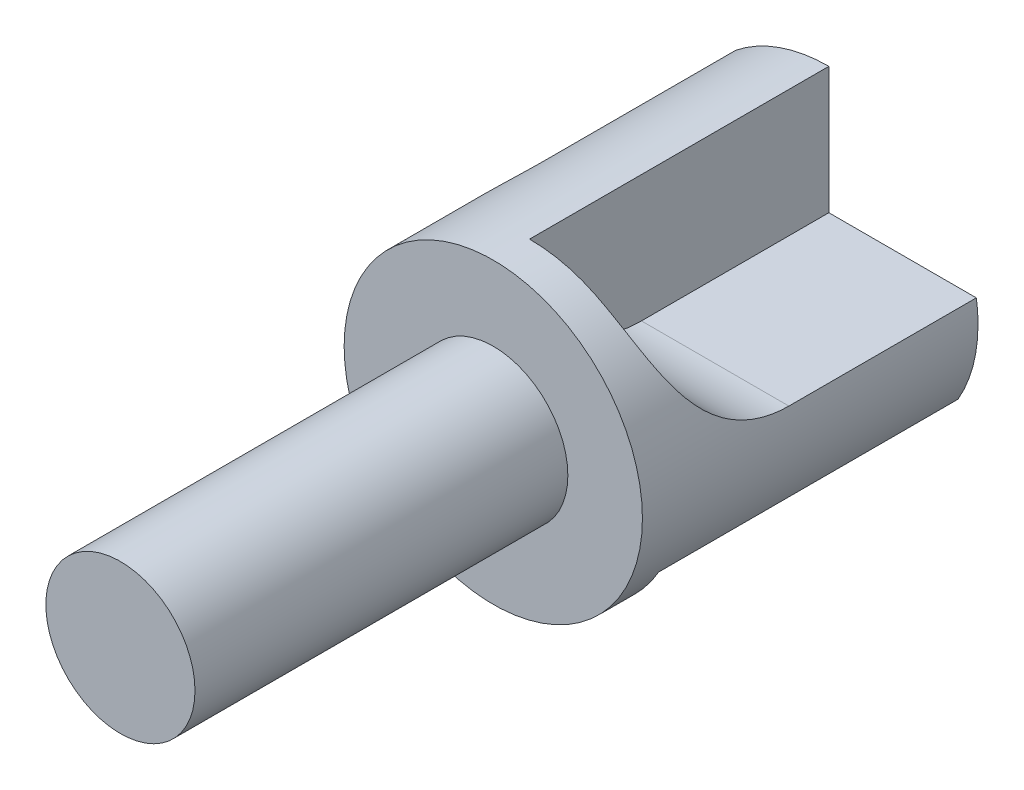
ISO-10303-21;
HEADER;
FILE_DESCRIPTION(('STEP AP214'),'2;1');
FILE_NAME('part.step','',(''),(''),'','','');
FILE_SCHEMA(('AUTOMOTIVE_DESIGN { 1 0 10303 214 1 1 1 1 }'));
ENDSEC;
DATA;
#1=APPLICATION_CONTEXT('core data for automotive mechanical design processes');
#2=APPLICATION_PROTOCOL_DEFINITION('international standard','automotive_design',2000,#1);
#3=PRODUCT_CONTEXT('',#1,'mechanical');
#4=PRODUCT('Part','Part','',(#3));
#5=PRODUCT_RELATED_PRODUCT_CATEGORY('part','',(#4));
#6=PRODUCT_DEFINITION_FORMATION('','',#4);
#7=PRODUCT_DEFINITION_CONTEXT('part definition',#1,'design');
#8=PRODUCT_DEFINITION('design','',#6,#7);
#9=PRODUCT_DEFINITION_SHAPE('','',#8);
#10=(LENGTH_UNIT() NAMED_UNIT(*) SI_UNIT(.MILLI.,.METRE.));
#11=(NAMED_UNIT(*) PLANE_ANGLE_UNIT() SI_UNIT($,.RADIAN.));
#12=(NAMED_UNIT(*) SI_UNIT($,.STERADIAN.) SOLID_ANGLE_UNIT());
#13=UNCERTAINTY_MEASURE_WITH_UNIT(LENGTH_MEASURE(1.E-05),#10,'distance_accuracy_value','');
#14=(GEOMETRIC_REPRESENTATION_CONTEXT(3) GLOBAL_UNCERTAINTY_ASSIGNED_CONTEXT((#13)) GLOBAL_UNIT_ASSIGNED_CONTEXT((#10,
#11,#12)) REPRESENTATION_CONTEXT('',''));
#15=CARTESIAN_POINT('',(0.,0.,0.));
#16=DIRECTION('',(0.,0.,1.));
#17=DIRECTION('',(1.,0.,0.));
#18=AXIS2_PLACEMENT_3D('',#15,#16,#17);
#19=CARTESIAN_POINT('',(0.,0.,-95.));
#20=DIRECTION('',(0.,0.,1.));
#21=DIRECTION('',(1.,0.,0.));
#22=AXIS2_PLACEMENT_3D('',#19,#20,#21);
#23=PLANE('',#22);
#24=DIRECTION('',(0.499999999999992,-0.866025403784443,0.));
#25=VECTOR('',#24,1.);
#26=CARTESIAN_POINT('',(-2.59807621135333,-1.49999999999998,-95.));
#27=LINE('',#26,#25);
#28=CARTESIAN_POINT('',(-12.4849361779958,15.6245437895438,-95.));
#29=VERTEX_POINT('',#28);
#30=CARTESIAN_POINT('',(-2.59807621135333,-1.49999999999998,-95.));
#31=VERTEX_POINT('',#30);
#32=EDGE_CURVE('E164',#29,#31,#27,.T.);
#33=ORIENTED_EDGE('',*,*,#32,.F.);
#34=CARTESIAN_POINT('',(0.,0.,-95.));
#35=DIRECTION('',(0.,0.,1.));
#36=DIRECTION('',(1.,0.,0.));
#37=AXIS2_PLACEMENT_3D('',#34,#35,#36);
#38=CIRCLE('',#37,20.);
#39=CARTESIAN_POINT('',(0.,20.,-95.));
#40=VERTEX_POINT('',#39);
#41=EDGE_CURVE('E194',#40,#29,#38,.T.);
#42=ORIENTED_EDGE('',*,*,#41,.F.);
#43=DIRECTION('',(0.,-1.,0.));
#44=VECTOR('',#43,1.);
#45=CARTESIAN_POINT('',(0.,0.,-95.));
#46=LINE('',#45,#44);
#47=CARTESIAN_POINT('',(0.,3.,-95.));
#48=VERTEX_POINT('',#47);
#49=EDGE_CURVE('E179',#40,#48,#46,.T.);
#50=ORIENTED_EDGE('',*,*,#49,.T.);
#51=DIRECTION('',(-1.,0.,0.));
#52=VECTOR('',#51,1.);
#53=CARTESIAN_POINT('',(0.,3.,-95.));
#54=LINE('',#53,#52);
#55=CARTESIAN_POINT('',(19.7737199332852,2.99999999999999,-95.));
#56=VERTEX_POINT('',#55);
#57=EDGE_CURVE('E182',#56,#48,#54,.T.);
#58=ORIENTED_EDGE('',*,*,#57,.F.);
#59=CARTESIAN_POINT('',(17.3205080756887,-10.0000000000001,-95.));
#60=VERTEX_POINT('',#59);
#61=EDGE_CURVE('E193',#60,#56,#38,.T.);
#62=ORIENTED_EDGE('',*,*,#61,.F.);
#63=DIRECTION('',(-0.866025403784436,0.500000000000004,0.));
#64=VECTOR('',#63,1.);
#65=CARTESIAN_POINT('',(0.,0.,-95.));
#66=LINE('',#65,#64);
#67=CARTESIAN_POINT('',(2.59807621135331,-1.50000000000001,-95.));
#68=VERTEX_POINT('',#67);
#69=EDGE_CURVE('E49',#60,#68,#66,.T.);
#70=ORIENTED_EDGE('',*,*,#69,.T.);
#71=DIRECTION('',(0.500000000000004,0.866025403784436,0.));
#72=VECTOR('',#71,1.);
#73=CARTESIAN_POINT('',(2.59807621135331,-1.50000000000001,-95.));
#74=LINE('',#73,#72);
#75=CARTESIAN_POINT('',(-7.28878375528937,-18.6245437895437,-95.));
#76=VERTEX_POINT('',#75);
#77=EDGE_CURVE('E161',#76,#68,#74,.T.);
#78=ORIENTED_EDGE('',*,*,#77,.F.);
#79=CARTESIAN_POINT('',(-17.3205080756889,-9.99999999999984,-95.));
#80=VERTEX_POINT('',#79);
#81=EDGE_CURVE('E198',#80,#76,#38,.T.);
#82=ORIENTED_EDGE('',*,*,#81,.F.);
#83=DIRECTION('',(0.866025403784443,0.499999999999992,0.));
#84=VECTOR('',#83,1.);
#85=CARTESIAN_POINT('',(0.,0.,-95.));
#86=LINE('',#85,#84);
#87=EDGE_CURVE('E57',#80,#31,#86,.T.);
#88=ORIENTED_EDGE('',*,*,#87,.T.);
#89=EDGE_LOOP('',(#33,#42,#50,#58,#62,#70,#78,#82,#88));
#90=FACE_BOUND('',#89,.T.);
#91=ADVANCED_FACE('F35',(#90),#23,.F.);
#92=CARTESIAN_POINT('',(0.,0.,0.));
#93=DIRECTION('',(0.,0.,1.));
#94=DIRECTION('',(1.,0.,0.));
#95=AXIS2_PLACEMENT_3D('',#92,#93,#94);
#96=CYLINDRICAL_SURFACE('',#95,20.);
#97=CARTESIAN_POINT('',(0.,0.,-50.));
#98=DIRECTION('',(0.,0.,1.));
#99=DIRECTION('',(1.,0.,0.));
#100=AXIS2_PLACEMENT_3D('',#97,#98,#99);
#101=CIRCLE('',#100,20.);
#102=CARTESIAN_POINT('',(20.,0.,-50.));
#103=VERTEX_POINT('',#102);
#104=EDGE_CURVE('E190',#103,#103,#101,.T.);
#105=ORIENTED_EDGE('',*,*,#104,.F.);
#106=EDGE_LOOP('',(#105));
#107=FACE_BOUND('',#106,.T.);
#108=DIRECTION('',(0.,0.,1.));
#109=VECTOR('',#108,1.);
#110=CARTESIAN_POINT('',(-12.4849361779958,15.6245437895438,0.));
#111=LINE('',#110,#109);
#112=CARTESIAN_POINT('',(-12.4849361779958,15.6245437895438,-69.8660687473185));
#113=VERTEX_POINT('',#112);
#114=EDGE_CURVE('E11',#113,#29,#111,.F.);
#115=ORIENTED_EDGE('',*,*,#114,.F.);
#116=CARTESIAN_POINT('',(-12.4849361779958,15.6245437895438,-69.8660687473185));
#117=CARTESIAN_POINT('',(-12.4849388560093,15.6245445950781,-70.2765568173716));
#118=CARTESIAN_POINT('',(-12.4982723505622,15.6139161041897,-70.6870960048679));
#119=CARTESIAN_POINT('',(-12.551394228603,15.571243896383,-71.5054971825263));
#120=CARTESIAN_POINT('',(-12.5911943070481,15.5391907123675,-71.9133579086452));
#121=CARTESIAN_POINT('',(-12.6966670533251,15.4531320118508,-72.7241959963691));
#122=CARTESIAN_POINT('',(-12.762389265022,15.3990844521208,-73.1271624745617));
#123=CARTESIAN_POINT('',(-12.9185322471459,15.2683293659461,-73.924499908596));
#124=CARTESIAN_POINT('',(-13.0089502387162,15.1916243889153,-74.3188718261402));
#125=CARTESIAN_POINT('',(-13.2129295895268,15.0145507788599,-75.0965105529148));
#126=CARTESIAN_POINT('',(-13.3265090450506,14.9141636330414,-75.4797684095354));
#127=CARTESIAN_POINT('',(-13.5746416499259,14.6886756106995,-76.2319891154629));
#128=CARTESIAN_POINT('',(-13.7091954921582,14.5635739177043,-76.6009514920212));
#129=CARTESIAN_POINT('',(-13.9965390733911,14.2876352816218,-77.3214433750374));
#130=CARTESIAN_POINT('',(-14.1493161585509,14.1368161652782,-77.6729847409535));
#131=CARTESIAN_POINT('',(-14.4700293974062,13.8083633826248,-78.3560655305448));
#132=CARTESIAN_POINT('',(-14.6379648025159,13.6307310401814,-78.6876059406093));
#133=CARTESIAN_POINT('',(-14.9799156552853,13.2538597938171,-79.3179843049604));
#134=CARTESIAN_POINT('',(-15.1535779918485,13.0554678080782,-79.6175197967092));
#135=CARTESIAN_POINT('',(-15.5079498058777,12.632480983604,-80.1930133740245));
#136=CARTESIAN_POINT('',(-15.6886591163469,12.4078867655498,-80.4689720178135));
#137=CARTESIAN_POINT('',(-16.0529413068879,11.932836367512,-80.9952298237671));
#138=CARTESIAN_POINT('',(-16.2365124690001,11.6823952315554,-81.2455437450766));
#139=CARTESIAN_POINT('',(-16.6023491595843,11.1563693359661,-81.7192439693527));
#140=CARTESIAN_POINT('',(-16.7846147674949,10.880786120406,-81.942631923994));
#141=CARTESIAN_POINT('',(-17.1308610592669,10.3263134581836,-82.3468417562552));
#142=CARTESIAN_POINT('',(-17.2952228109967,10.0490387767375,-82.5295573638467));
#143=CARTESIAN_POINT('',(-17.6158704086444,9.47570373669992,-82.8709727905216));
#144=CARTESIAN_POINT('',(-17.772156692678,9.17964439917201,-83.0296739133581));
#145=CARTESIAN_POINT('',(-18.0737006726171,8.57069390037275,-83.3235605005899));
#146=CARTESIAN_POINT('',(-18.2189571736261,8.25780092170752,-83.4587434192153));
#147=CARTESIAN_POINT('',(-18.495851225596,7.61742645336982,-83.706588699384));
#148=CARTESIAN_POINT('',(-18.6274882977309,7.28994445136151,-83.8192502692614));
#149=CARTESIAN_POINT('',(-18.8767396185688,6.61807169392278,-84.0249324824785));
#150=CARTESIAN_POINT('',(-18.9941329648651,6.2735089365399,-84.1176576393008));
#151=CARTESIAN_POINT('',(-19.2110012044641,5.5741795765726,-84.2833376966678));
#152=CARTESIAN_POINT('',(-19.3104760535986,5.21941294883869,-84.3562925484801));
#153=CARTESIAN_POINT('',(-19.4902629710051,4.50183445902153,-84.4845818042693));
#154=CARTESIAN_POINT('',(-19.5705689623354,4.13902008536337,-84.5399106222683));
#155=CARTESIAN_POINT('',(-19.7110984210887,3.4075425482669,-84.6351775942408));
#156=CARTESIAN_POINT('',(-19.7713205879565,3.03887900767665,-84.6751147515325));
#157=CARTESIAN_POINT('',(-19.8789832941454,2.2390823077362,-84.7471619369963));
#158=CARTESIAN_POINT('',(-19.9229062331266,1.80727330016892,-84.777041683214));
#159=CARTESIAN_POINT('',(-19.9825703664539,0.940987490073355,-84.8227358570986));
#160=CARTESIAN_POINT('',(-19.998309223688,0.506510469302381,-84.838549118274));
#161=CARTESIAN_POINT('',(-20.001433598143,-0.363073144815604,-84.8594431629183));
#162=CARTESIAN_POINT('',(-19.9888003433531,-0.798179964523515,-84.8645168363751));
#163=CARTESIAN_POINT('',(-19.9351844756252,-1.66666002619853,-84.8670037217522));
#164=CARTESIAN_POINT('',(-19.8942000808946,-2.10003315748615,-84.8644164521694));
#165=CARTESIAN_POINT('',(-19.7729649457267,-3.05008085683375,-84.8533893451729));
#166=CARTESIAN_POINT('',(-19.6864688571386,-3.56595582126459,-84.8438758481531));
#167=CARTESIAN_POINT('',(-19.4733510362661,-4.58931890920119,-84.8221183118294));
#168=CARTESIAN_POINT('',(-19.3467249483796,-5.09680611602849,-84.8098739761703));
#169=CARTESIAN_POINT('',(-19.0540978421257,-6.10037250224661,-84.7861349538014));
#170=CARTESIAN_POINT('',(-18.8880935752787,-6.59645073675546,-84.7746403290383));
#171=CARTESIAN_POINT('',(-18.5177148378756,-7.57413488835499,-84.755011739617));
#172=CARTESIAN_POINT('',(-18.3133402012639,-8.05574074280304,-84.7468777895031));
#173=CARTESIAN_POINT('',(-17.8508742651342,-9.03668725120949,-84.7352033786866));
#174=CARTESIAN_POINT('',(-17.5899196637306,-9.53468597333757,-84.732049217554));
#175=CARTESIAN_POINT('',(-17.0270111373269,-10.5069731874892,-84.7322296663077));
#176=CARTESIAN_POINT('',(-16.7250546798151,-10.9812602124634,-84.7355646771726));
#177=CARTESIAN_POINT('',(-16.0821657809494,-11.9029327103123,-84.7479898678782));
#178=CARTESIAN_POINT('',(-15.7412126151872,-12.3503036844001,-84.757083119632));
#179=CARTESIAN_POINT('',(-15.0229097835634,-13.214687476062,-84.7789018843821));
#180=CARTESIAN_POINT('',(-14.6455607377233,-13.6317008105811,-84.7916273355093));
#181=CARTESIAN_POINT('',(-13.8586873256462,-14.4308694093808,-84.8172503860117));
#182=CARTESIAN_POINT('',(-13.449298198369,-14.8131578814905,-84.8301470892918));
#183=CARTESIAN_POINT('',(-12.5997985225637,-15.5421474212402,-84.8516717735068));
#184=CARTESIAN_POINT('',(-12.1596857931065,-15.8888459581879,-84.8602994510505));
#185=CARTESIAN_POINT('',(-11.2521133494602,-16.5439716960761,-84.8678095765551));
#186=CARTESIAN_POINT('',(-10.7846691313465,-16.8524202797633,-84.8666974944361));
#187=CARTESIAN_POINT('',(-9.82580941066607,-17.4288891228456,-84.8484285518367));
#188=CARTESIAN_POINT('',(-9.33439952398189,-17.6969187939486,-84.8312754332969));
#189=CARTESIAN_POINT('',(-8.43507262367495,-18.1396408262291,-84.779824658412));
#190=CARTESIAN_POINT('',(-8.03076775106434,-18.3221925462472,-84.7497781700545));
#191=CARTESIAN_POINT('',(-7.21243106370216,-18.6594906214705,-84.6714103154312));
#192=CARTESIAN_POINT('',(-6.79840045507123,-18.8142404041157,-84.6230912041092));
#193=CARTESIAN_POINT('',(-5.96413441701259,-19.0950949077421,-84.5044219639013));
#194=CARTESIAN_POINT('',(-5.54390395604561,-19.2212213663345,-84.4340886506516));
#195=CARTESIAN_POINT('',(-4.70080301016365,-19.4446030678567,-84.2676770416043));
#196=CARTESIAN_POINT('',(-4.27793249898262,-19.5418580230726,-84.1715984892653));
#197=CARTESIAN_POINT('',(-3.43008886180597,-19.7084467239093,-83.9492622303785));
#198=CARTESIAN_POINT('',(-3.00513416731181,-19.7775052282754,-83.8227253384138));
#199=CARTESIAN_POINT('',(-2.16249525948923,-19.8872852805619,-83.537115126894));
#200=CARTESIAN_POINT('',(-1.74481106190667,-19.9280067671198,-83.3780417368836));
#201=CARTESIAN_POINT('',(-0.922718189569013,-19.9829477160218,-83.025559024581));
#202=CARTESIAN_POINT('',(-0.518299807981444,-19.997187000912,-82.8321755030943));
#203=CARTESIAN_POINT('',(0.271855311659246,-20.0020538064562,-82.4101978573861));
#204=CARTESIAN_POINT('',(0.657595038312627,-19.9926851172133,-82.1816093906161));
#205=CARTESIAN_POINT('',(1.3484034222376,-19.9570225231409,-81.7269907124691));
#206=CARTESIAN_POINT('',(1.65683589638892,-19.9335101410291,-81.5058273780411));
#207=CARTESIAN_POINT('',(2.25366818251381,-19.8748804048866,-81.0393780127454));
#208=CARTESIAN_POINT('',(2.54207027840324,-19.8397643765714,-80.7940947398261));
#209=CARTESIAN_POINT('',(3.09657840947892,-19.760811894362,-80.2807295323183));
#210=CARTESIAN_POINT('',(3.36268103665468,-19.7169741109705,-80.0126441254665));
#211=CARTESIAN_POINT('',(3.87075987511725,-19.623556294618,-79.4554408254582));
#212=CARTESIAN_POINT('',(4.1127354257666,-19.5739761045013,-79.1663223567578));
#213=CARTESIAN_POINT('',(4.56533167041582,-19.4733181285762,-78.5767732066347));
#214=CARTESIAN_POINT('',(4.77660017176099,-19.4223119662396,-78.2768267188189));
#215=CARTESIAN_POINT('',(5.17418576360317,-19.3201951708944,-77.6608747900893));
#216=CARTESIAN_POINT('',(5.36050363455768,-19.2690845412043,-77.3448698519116));
#217=CARTESIAN_POINT('',(5.70771469418713,-19.1691066627496,-76.6988082348763));
#218=CARTESIAN_POINT('',(5.86860460415169,-19.1202397038618,-76.368749750892));
#219=CARTESIAN_POINT('',(6.16466185009109,-19.0268505972777,-75.6966944361243));
#220=CARTESIAN_POINT('',(6.29982787903843,-18.9823286704079,-75.3546969997683));
#221=CARTESIAN_POINT('',(6.55286834099547,-18.8965346362549,-74.6365628452302));
#222=CARTESIAN_POINT('',(6.66887031298193,-18.8557081045948,-74.2597120645201));
#223=CARTESIAN_POINT('',(6.87123973038725,-18.7829079700861,-73.4972978305574));
#224=CARTESIAN_POINT('',(6.95760602355425,-18.750934711467,-73.1117340391592));
#225=CARTESIAN_POINT('',(7.10074077954609,-18.697201225688,-72.3343643145016));
#226=CARTESIAN_POINT('',(7.15750280854053,-18.675443218689,-71.9425570434113));
#227=CARTESIAN_POINT('',(7.24143753091021,-18.6430577841822,-71.1553299268343));
#228=CARTESIAN_POINT('',(7.2686097060989,-18.6324305516,-70.7599100182042));
#229=CARTESIAN_POINT('',(7.29394126767888,-18.6225303452376,-69.9502566301358));
#230=CARTESIAN_POINT('',(7.29074698473162,-18.6237871213751,-69.5359735886962));
#231=CARTESIAN_POINT('',(7.25207802559355,-18.638878386092,-68.709136260454));
#232=CARTESIAN_POINT('',(7.21660223968459,-18.6527133070613,-68.2965820335714));
#233=CARTESIAN_POINT('',(7.11332710743882,-18.6923415851914,-67.4760354570572));
#234=CARTESIAN_POINT('',(7.04552163285925,-18.7181372095335,-67.0680439873298));
#235=CARTESIAN_POINT('',(6.87754307274594,-18.78050635534,-66.2596153394524));
#236=CARTESIAN_POINT('',(6.77737018052817,-18.817079812433,-65.8591781161993));
#237=CARTESIAN_POINT('',(6.5441154789633,-18.899468545701,-65.0669776077705));
#238=CARTESIAN_POINT('',(6.41088665263933,-18.9453249354652,-64.6752618310291));
#239=CARTESIAN_POINT('',(6.11183098542198,-19.0439043665413,-63.9053509312971));
#240=CARTESIAN_POINT('',(5.9460037492872,-19.0966274911067,-63.5271559723062));
#241=CARTESIAN_POINT('',(5.5820582970805,-19.2061633401887,-62.7873406134673));
#242=CARTESIAN_POINT('',(5.38394725075848,-19.2629751551078,-62.4257165562651));
#243=CARTESIAN_POINT('',(4.95598306179941,-19.3774938009964,-61.721905084845));
#244=CARTESIAN_POINT('',(4.72613140478076,-19.4352005899644,-61.3797167619955));
#245=CARTESIAN_POINT('',(4.24439116342046,-19.5459462198962,-60.7293461520465));
#246=CARTESIAN_POINT('',(3.99357057960101,-19.5990779881351,-60.4203889056844));
#247=CARTESIAN_POINT('',(3.46477746006156,-19.6994340006554,-59.8255956726275));
#248=CARTESIAN_POINT('',(3.18680566944888,-19.7466584069707,-59.5397590518294));
#249=CARTESIAN_POINT('',(2.60595677771956,-19.8316677744522,-58.9934975801437));
#250=CARTESIAN_POINT('',(2.30309753877767,-19.869459428369,-58.733054792169));
#251=CARTESIAN_POINT('',(1.67499639409361,-19.9322336097005,-58.2390087260842));
#252=CARTESIAN_POINT('',(1.34975595981534,-19.957216978292,-58.0054036862023));
#253=CARTESIAN_POINT('',(0.704302159816196,-19.9900160359226,-57.5818839360599));
#254=CARTESIAN_POINT('',(0.385411103790001,-19.9989377035824,-57.3900349609748));
#255=CARTESIAN_POINT('',(-0.265792480281265,-20.0008834384256,-57.0306146330377));
#256=CARTESIAN_POINT('',(-0.598104259568107,-19.9939083913055,-56.8630419281697));
#257=CARTESIAN_POINT('',(-1.27296079065285,-19.9623065893218,-56.5518631588347));
#258=CARTESIAN_POINT('',(-1.61550631107147,-19.9376785053898,-56.4082588999167));
#259=CARTESIAN_POINT('',(-2.30753954939837,-19.8694780268077,-56.1441746921828));
#260=CARTESIAN_POINT('',(-2.65702746956496,-19.8259050794475,-56.0236954181786));
#261=CARTESIAN_POINT('',(-3.36060968933859,-19.7188549249632,-55.8042580755178));
#262=CARTESIAN_POINT('',(-3.71471309560165,-19.6553297644424,-55.7053528389524));
#263=CARTESIAN_POINT('',(-4.42371657789966,-19.5079944362614,-55.5276900180815));
#264=CARTESIAN_POINT('',(-4.7786166499745,-19.4241843692142,-55.4489323338482));
#265=CARTESIAN_POINT('',(-5.48665763153911,-19.2361847953943,-55.3095224451558));
#266=CARTESIAN_POINT('',(-5.83979798030417,-19.1319891716651,-55.2488756889543));
#267=CARTESIAN_POINT('',(-6.54189493537403,-18.9034374796417,-55.1435347226216));
#268=CARTESIAN_POINT('',(-6.89085127066793,-18.7790801129073,-55.0988415405135));
#269=CARTESIAN_POINT('',(-7.63369760599096,-18.4907532035489,-55.0175727155995));
#270=CARTESIAN_POINT('',(-8.02660856496578,-18.32364567865,-54.9831721863259));
#271=CARTESIAN_POINT('',(-8.80173154564653,-17.9641893233363,-54.9290654941343));
#272=CARTESIAN_POINT('',(-9.18394273139016,-17.7718385273315,-54.9093604762949));
#273=CARTESIAN_POINT('',(-9.93578685731186,-17.3627020350474,-54.8814004358212));
#274=CARTESIAN_POINT('',(-10.3054115040711,-17.1459006186086,-54.873152825454));
#275=CARTESIAN_POINT('',(-11.0300380841771,-16.6889717895042,-54.8650962490305));
#276=CARTESIAN_POINT('',(-11.3850390852145,-16.448842892896,-54.8652878201712));
#277=CARTESIAN_POINT('',(-12.1498829667086,-15.894859870661,-54.8719379690439));
#278=CARTESIAN_POINT('',(-12.5560820528134,-15.5759746385878,-54.8796710093793));
#279=CARTESIAN_POINT('',(-13.3425727069319,-14.9077863112934,-54.89902734734));
#280=CARTESIAN_POINT('',(-13.7228614321675,-14.5584798879324,-54.9106510710104));
#281=CARTESIAN_POINT('',(-14.4553504150578,-13.8314545447329,-54.9341927920998));
#282=CARTESIAN_POINT('',(-14.8075464183966,-13.4537313382699,-54.9461108337333));
#283=CARTESIAN_POINT('',(-15.481705235448,-12.6721415514659,-54.967437482336));
#284=CARTESIAN_POINT('',(-15.80366770132,-12.2682746704289,-54.9768460604359));
#285=CARTESIAN_POINT('',(-16.442261656233,-11.4003137503462,-54.9918612626978));
#286=CARTESIAN_POINT('',(-16.7559518970348,-10.9340436036127,-54.997062319487));
#287=CARTESIAN_POINT('',(-17.3430191889037,-9.97672326144551,-55.0010520066418));
#288=CARTESIAN_POINT('',(-17.6163935468907,-9.48567141354525,-54.9998402088312));
#289=CARTESIAN_POINT('',(-18.1209508556091,-8.48213911280022,-54.9912695431667));
#290=CARTESIAN_POINT('',(-18.3521157164911,-7.96964958745342,-54.9839080472183));
#291=CARTESIAN_POINT('',(-18.7704667687874,-6.92712421171099,-54.964708975176));
#292=CARTESIAN_POINT('',(-18.9576538234094,-6.3970887059454,-54.95287148695));
#293=CARTESIAN_POINT('',(-19.2860048580893,-5.32564890855583,-54.927774249963));
#294=CARTESIAN_POINT('',(-19.4273759627048,-4.78430790140285,-54.9145212726319));
#295=CARTESIAN_POINT('',(-19.6643015050414,-3.6915845446514,-54.8906693871639));
#296=CARTESIAN_POINT('',(-19.7598528690145,-3.1402015239743,-54.8800706571059));
#297=CARTESIAN_POINT('',(-19.9044182920293,-2.03141266133283,-54.8666742864604));
#298=CARTESIAN_POINT('',(-19.9534451658355,-1.47400852064048,-54.8638744973113));
#299=CARTESIAN_POINT('',(-20.0046171500885,-0.35718126328975,-54.872098572172));
#300=CARTESIAN_POINT('',(-20.0067721121859,0.202241404386612,-54.8831195307889));
#301=CARTESIAN_POINT('',(-19.9682895626287,1.21386612157393,-54.9217602185841));
#302=CARTESIAN_POINT('',(-19.9355962147559,1.66651378186438,-54.9458820322013));
#303=CARTESIAN_POINT('',(-19.8397057393197,2.5673207066223,-55.0116443954531));
#304=CARTESIAN_POINT('',(-19.7765108183836,3.01548029338445,-55.0532836777635));
#305=CARTESIAN_POINT('',(-19.6205410971763,3.90350089850979,-55.1580554765006));
#306=CARTESIAN_POINT('',(-19.5278056376545,4.34337213439145,-55.2211594148086));
#307=CARTESIAN_POINT('',(-19.3141765103579,5.21175334119677,-55.3728812000385));
#308=CARTESIAN_POINT('',(-19.1932873162398,5.64026510511511,-55.4614949939466));
#309=CARTESIAN_POINT('',(-18.9465406135544,6.41619538612462,-55.6518413088965));
#310=CARTESIAN_POINT('',(-18.8244030121915,6.76583262386264,-55.749368042609));
#311=CARTESIAN_POINT('',(-18.5636214835391,7.45160822599238,-55.9671907645579));
#312=CARTESIAN_POINT('',(-18.4249792524134,7.78774797276743,-56.08748441381));
#313=CARTESIAN_POINT('',(-18.1336645133786,8.44387443585858,-56.3523362248823));
#314=CARTESIAN_POINT('',(-17.9809970160381,8.76386685804679,-56.4968857363594));
#315=CARTESIAN_POINT('',(-17.6645274196038,9.38541929080936,-56.8112831360942));
#316=CARTESIAN_POINT('',(-17.5007251763948,9.68697906271713,-56.9811313518225));
#317=CARTESIAN_POINT('',(-17.1648856031553,10.2703611978067,-57.3470236650202));
#318=CARTESIAN_POINT('',(-16.9928263568633,10.5521255152833,-57.5431402701526));
#319=CARTESIAN_POINT('',(-16.6445991132719,11.0932806429011,-57.9609377788035));
#320=CARTESIAN_POINT('',(-16.4684310793261,11.3526712533931,-58.1826189104028));
#321=CARTESIAN_POINT('',(-16.1157870729764,11.8479478636934,-58.6507071922869));
#322=CARTESIAN_POINT('',(-15.9393110551984,12.0838300384733,-58.8971183533162));
#323=CARTESIAN_POINT('',(-15.5898649332765,12.5314307056834,-59.4132464043681));
#324=CARTESIAN_POINT('',(-15.4168947730018,12.743149585234,-59.6829629208939));
#325=CARTESIAN_POINT('',(-15.0855845820268,13.1334592652093,-60.2314410447204));
#326=CARTESIAN_POINT('',(-14.9269359821975,13.3131040102589,-60.5092683459618));
#327=CARTESIAN_POINT('',(-14.6189969046718,13.650535392607,-61.0827796781205));
#328=CARTESIAN_POINT('',(-14.4697061507882,13.8083226751727,-61.378463181524));
#329=CARTESIAN_POINT('',(-14.1829751756745,14.102676103821,-61.9859472227737));
#330=CARTESIAN_POINT('',(-14.045541927219,14.2392298009042,-62.2977570736276));
#331=CARTESIAN_POINT('',(-13.7848817852142,14.4917206879089,-62.9353392246192));
#332=CARTESIAN_POINT('',(-13.6616552292439,14.6076573879656,-63.2611118562879));
#333=CARTESIAN_POINT('',(-13.4243903282863,14.8261026202917,-63.9446325351865));
#334=CARTESIAN_POINT('',(-13.3113557719065,14.9273779669459,-64.3031236501454));
#335=CARTESIAN_POINT('',(-13.1053452336799,15.1085656337647,-65.0311405458154));
#336=CARTESIAN_POINT('',(-13.0123719931791,15.1884750346641,-65.4006678267565));
#337=CARTESIAN_POINT('',(-12.8481451552869,15.3276461610226,-66.1477263708014));
#338=CARTESIAN_POINT('',(-12.7768592466789,15.3869386219853,-66.5252448215931));
#339=CARTESIAN_POINT('',(-12.6569772490144,15.4857023583701,-67.286288919452));
#340=CARTESIAN_POINT('',(-12.6083723696727,15.5251813131856,-67.6698121796269));
#341=CARTESIAN_POINT('',(-12.5427148014869,15.5782421188539,-68.3554870626527));
#342=CARTESIAN_POINT('',(-12.5210663501803,15.5956162186612,-68.6569194887771));
#343=CARTESIAN_POINT('',(-12.4921760406154,15.6187667657786,-69.2609149323722));
#344=CARTESIAN_POINT('',(-12.4849342039013,15.6245431957452,-69.563477951533));
#345=CARTESIAN_POINT('',(-12.4849361779958,15.6245437895438,-69.8660687473185));
#346=B_SPLINE_CURVE_WITH_KNOTS('',3,(#116,#117,#118,#119,#120,#121,#122,#123,#124,#125,#126,
#127,#128,#129,#130,#131,#132,#133,#134,#135,#136,#137,#138,#139,#140,#141,#142,#143,#144,#145,
#146,#147,#148,#149,#150,#151,#152,#153,#154,#155,#156,#157,#158,#159,#160,#161,#162,#163,#164,
#165,#166,#167,#168,#169,#170,#171,#172,#173,#174,#175,#176,#177,#178,#179,#180,#181,#182,#183,
#184,#185,#186,#187,#188,#189,#190,#191,#192,#193,#194,#195,#196,#197,#198,#199,#200,#201,#202,
#203,#204,#205,#206,#207,#208,#209,#210,#211,#212,#213,#214,#215,#216,#217,#218,#219,#220,#221,
#222,#223,#224,#225,#226,#227,#228,#229,#230,#231,#232,#233,#234,#235,#236,#237,#238,#239,#240,
#241,#242,#243,#244,#245,#246,#247,#248,#249,#250,#251,#252,#253,#254,#255,#256,#257,#258,#259,
#260,#261,#262,#263,#264,#265,#266,#267,#268,#269,#270,#271,#272,#273,#274,#275,#276,#277,#278,
#279,#280,#281,#282,#283,#284,#285,#286,#287,#288,#289,#290,#291,#292,#293,#294,#295,#296,#297,
#298,#299,#300,#301,#302,#303,#304,#305,#306,#307,#308,#309,#310,#311,#312,#313,#314,#315,#316,
#317,#318,#319,#320,#321,#322,#323,#324,#325,#326,#327,#328,#329,#330,#331,#332,#333,#334,#335,
#336,#337,#338,#339,#340,#341,#342,#343,#344,#345),.UNSPECIFIED.,.T.,.F.,(4,2,2,2,2,2,2,2,2,2,2,
2,2,2,2,2,2,2,2,2,2,2,2,2,2,2,2,2,2,2,2,2,2,2,2,2,2,2,2,2,2,2,2,2,2,2,2,2,2,2,2,2,2,2,2,2,2,2,2,
2,2,2,2,2,2,2,2,2,2,2,2,2,2,2,2,2,2,2,2,2,2,2,2,2,2,2,2,2,2,2,2,2,2,2,2,2,2,2,2,2,2,2,2,2,2,2,2,
2,2,2,2,2,2,2,4),(0.,1.23119889211008,2.46294218371251,3.69705115097648,4.93102130909127,
6.16595929996852,7.40093809518757,8.63506428502451,9.86912956148705,11.0646965677405,
12.2602352590387,13.4550819779346,14.6498553659946,15.760058993158,16.8702023254205,
17.9804657524557,19.0907682003927,20.2165384778115,21.3423115301542,22.4684410042542,
23.5946433882386,24.8985986618008,26.2026620583942,27.5075885244528,28.8125970090713,
30.3804063063643,31.9483858277748,33.5164947437389,35.0846104461701,36.7692641483486,
38.4540219518553,40.1396792999871,41.8253079371908,43.5041701114209,45.1831515818788,
46.8611901846037,48.5388374438663,49.8714796342387,51.2039574227559,52.5354198665338,
53.8668955783157,55.2110745336112,56.5552563996572,57.8984317086249,59.2413913934727,
60.3807350467653,61.519948575124,62.6593358922819,63.7987543991022,64.9087806998612,
66.0187722708044,67.1289068487692,68.239097817497,69.4269940535321,70.6149364704095,
71.8031369527648,72.991358242915,74.2327876930707,75.4742598205715,76.7159673684964,
77.9576675003996,79.204992348436,80.4523323206712,81.6993956539962,82.9464006383283,
84.1492664509544,85.352099262747,86.5540761958573,87.7559741796999,88.871386921545,
89.9867375189129,91.1021720980324,92.2176392217716,93.3358080568562,94.4539713459426,
95.5724706707596,96.6910420568976,97.9748871985834,99.258832367407,100.54360778684,
101.828464988909,103.376256386251,104.924217328335,106.472412247776,108.020624977208,
109.704551189777,111.388589836843,113.073348531969,114.758074155453,116.435073644619,
118.112185617028,119.788835509397,121.465132996071,122.827271021173,124.189310517562,
125.549543642107,126.909560771546,128.057323144697,129.204967665154,130.352203768808,
131.49945472377,132.649940288995,133.800436119384,134.951118840951,136.101783124834,
137.201323200903,138.300830809868,139.400980636139,140.50115659874,141.667749845016,
142.834502403541,143.999508046998,145.164061803793,146.071637255047,146.979214063517),.UNSPECIFIED.);
#347=CARTESIAN_POINT('',(-19.9473562116606,-1.45016556472906,-54.8660687473185));
#348=VERTEX_POINT('',#347);
#349=EDGE_CURVE('E42',#348,#113,#346,.T.);
#350=ORIENTED_EDGE('',*,*,#349,.F.);
#351=CARTESIAN_POINT('',(0.,0.,-54.8660687473185));
#352=DIRECTION('',(0.,0.,-1.));
#353=DIRECTION('',(-1.,0.,0.));
#354=AXIS2_PLACEMENT_3D('',#351,#352,#353);
#355=CIRCLE('',#354,20.);
#356=CARTESIAN_POINT('',(-17.3205080756889,-9.99999999999984,-54.8660687473185));
#357=VERTEX_POINT('',#356);
#358=EDGE_CURVE('E129',#357,#348,#355,.T.);
#359=ORIENTED_EDGE('',*,*,#358,.F.);
#360=DIRECTION('',(0.,0.,1.));
#361=VECTOR('',#360,1.);
#362=CARTESIAN_POINT('',(-17.3205080756889,-9.99999999999984,0.));
#363=LINE('',#362,#361);
#364=EDGE_CURVE('E140',#357,#80,#363,.F.);
#365=ORIENTED_EDGE('',*,*,#364,.T.);
#366=ORIENTED_EDGE('',*,*,#81,.T.);
#367=DIRECTION('',(0.,0.,1.));
#368=VECTOR('',#367,1.);
#369=CARTESIAN_POINT('',(-7.28878375528937,-18.6245437895437,0.));
#370=LINE('',#369,#368);
#371=CARTESIAN_POINT('',(-7.28878375528936,-18.6245437895437,-69.8660687473185));
#372=VERTEX_POINT('',#371);
#373=EDGE_CURVE('E278',#372,#76,#370,.F.);
#374=ORIENTED_EDGE('',*,*,#373,.F.);
#375=CARTESIAN_POINT('',(11.2295583245791,-16.5498344352708,-54.8660687473185));
#376=CARTESIAN_POINT('',(11.0297846960521,-16.6853867687993,-54.8660730009485));
#377=CARTESIAN_POINT('',(10.8275736086359,-16.8173095267159,-54.8671759306577));
#378=CARTESIAN_POINT('',(10.4185170691759,-17.0737457963837,-54.8721088605679));
#379=CARTESIAN_POINT('',(10.2116712347222,-17.1982586936303,-54.8759390866047));
#380=CARTESIAN_POINT('',(9.58422082303259,-17.5606394352732,-54.8923249235602));
#381=CARTESIAN_POINT('',(9.15705976349363,-17.7871075155393,-54.9097775761928));
#382=CARTESIAN_POINT('',(8.28579858161307,-18.2093742750545,-54.9624479807828));
#383=CARTESIAN_POINT('',(7.84161392198787,-18.4049856141733,-54.997769152912));
#384=CARTESIAN_POINT('',(6.94239285707633,-18.7626500891037,-55.0911304438384));
#385=CARTESIAN_POINT('',(6.48736197847387,-18.9247199248833,-55.1491592149502));
#386=CARTESIAN_POINT('',(5.64988856344815,-19.1895029587941,-55.2804825573447));
#387=CARTESIAN_POINT('',(5.26846920841637,-19.2976327758109,-55.3494151124824));
#388=CARTESIAN_POINT('',(4.50413110879251,-19.4902040167251,-55.5089378072496));
#389=CARTESIAN_POINT('',(4.12121240662911,-19.5746461060981,-55.5995273383224));
#390=CARTESIAN_POINT('',(3.35852976392541,-19.7197995388805,-55.8045004449837));
#391=CARTESIAN_POINT('',(2.97875971672195,-19.780583837652,-55.9188091769434));
#392=CARTESIAN_POINT('',(2.22498529095844,-19.8794847187297,-56.1734056413863));
#393=CARTESIAN_POINT('',(1.85098082218656,-19.917601656055,-56.3136929669444));
#394=CARTESIAN_POINT('',(1.11043165878662,-19.9726232327684,-56.6226664506053));
#395=CARTESIAN_POINT('',(0.743949765290074,-19.9893910142953,-56.7915280484568));
#396=CARTESIAN_POINT('',(0.0251003053502935,-20.0032153273677,-57.1577551756164));
#397=CARTESIAN_POINT('',(-0.327267047397557,-20.000271560592,-57.3551211362749));
#398=CARTESIAN_POINT('',(-1.01414644192749,-19.9772297364825,-57.7784417275025));
#399=CARTESIAN_POINT('',(-1.34864567863894,-19.9571195476446,-58.0044164796833));
#400=CARTESIAN_POINT('',(-1.99595609901848,-19.9028056777448,-58.4840105488978));
#401=CARTESIAN_POINT('',(-2.30876854726827,-19.8686028192516,-58.7376282518172));
#402=CARTESIAN_POINT('',(-2.88262048105623,-19.7930942759277,-59.2469140498598));
#403=CARTESIAN_POINT('',(-3.14578467585573,-19.7527079893116,-59.5003321441681));
#404=CARTESIAN_POINT('',(-3.64998022324307,-19.6657848717674,-60.0272903966808));
#405=CARTESIAN_POINT('',(-3.89101303578652,-19.6192484470442,-60.3008292254202));
#406=CARTESIAN_POINT('',(-4.34965970700808,-19.5226895837147,-60.8663000293445));
#407=CARTESIAN_POINT('',(-4.56727275777981,-19.472667024946,-61.1582326385052));
#408=CARTESIAN_POINT('',(-4.97817241433698,-19.3716951975628,-61.7585859775625));
#409=CARTESIAN_POINT('',(-5.1714581869833,-19.3207458972784,-62.067007271634));
#410=CARTESIAN_POINT('',(-5.53939985041536,-19.2185530585329,-62.7093157645378));
#411=CARTESIAN_POINT('',(-5.71317513704803,-19.1673608006331,-63.0437154418148));
#412=CARTESIAN_POINT('',(-6.03368514584049,-19.0688952072201,-63.7257987113513));
#413=CARTESIAN_POINT('',(-6.18041810469117,-19.0216221273693,-64.0734831680684));
#414=CARTESIAN_POINT('',(-6.44665352208909,-18.9330490229902,-64.7798399780864));
#415=CARTESIAN_POINT('',(-6.56615654623722,-18.8917488744028,-65.1385121029836));
#416=CARTESIAN_POINT('',(-6.77786922454862,-18.816830735878,-65.864558869658));
#417=CARTESIAN_POINT('',(-6.87008346035181,-18.7832114565806,-66.2319320393777));
#418=CARTESIAN_POINT('',(-7.00542812442117,-18.7330616929286,-66.8702297431374));
#419=CARTESIAN_POINT('',(-7.05507818181684,-18.7143780037669,-67.1396259275699));
#420=CARTESIAN_POINT('',(-7.14016049909174,-18.6820817055767,-67.6809236715932));
#421=CARTESIAN_POINT('',(-7.17559501793338,-18.6684682908658,-67.9528248260939));
#422=CARTESIAN_POINT('',(-7.23221684972573,-18.6466085148408,-68.4978440366293));
#423=CARTESIAN_POINT('',(-7.25342853788164,-18.6383529719449,-68.7709591990335));
#424=CARTESIAN_POINT('',(-7.28171242067996,-18.6273105436587,-69.3180718817419));
#425=CARTESIAN_POINT('',(-7.28878250334528,-18.6245244751078,-69.5920695277213));
#426=CARTESIAN_POINT('',(-7.28878375528936,-18.6245437895437,-69.8660687473185));
#427=B_SPLINE_CURVE_WITH_KNOTS('',3,(#375,#376,#377,#378,#379,#380,#381,#382,#383,#384,#385,
#386,#387,#388,#389,#390,#391,#392,#393,#394,#395,#396,#397,#398,#399,#400,#401,#402,#403,#404,
#405,#406,#407,#408,#409,#410,#411,#412,#413,#414,#415,#416,#417,#418,#419,#420,#421,#422,#423,
#424,#425,#426),.UNSPECIFIED.,.F.,.F.,(4,2,2,2,2,2,2,2,2,2,2,2,2,2,2,2,2,2,2,2,2,2,2,2,2,4),(0.,
0.724174997655315,1.44840996815565,2.89816865057049,4.3564159846099,5.81393551633054,
7.01995251313865,8.22593562509765,9.42816971597366,10.6303849768131,11.8402688126618,
13.0501709593398,14.2609288519553,15.4716160843939,16.5730585178643,17.6744282394683,
18.7758359426116,19.8772813555343,21.0169955074406,22.1567839487306,23.2965487129849,
24.4361220081917,25.2594338509371,26.0826148109953,26.9043813660134,27.72627063854),.UNSPECIFIED.);
#428=CARTESIAN_POINT('',(11.2295583245791,-16.5498344352708,-54.8660687473185));
#429=VERTEX_POINT('',#428);
#430=EDGE_CURVE('E269',#429,#372,#427,.T.);
#431=ORIENTED_EDGE('',*,*,#430,.F.);
#432=CARTESIAN_POINT('',(0.,0.,-54.8660687473185));
#433=DIRECTION('',(0.,0.,-1.));
#434=DIRECTION('',(-1.,0.,0.));
#435=AXIS2_PLACEMENT_3D('',#432,#433,#434);
#436=CIRCLE('',#435,20.);
#437=CARTESIAN_POINT('',(17.3205080756887,-10.0000000000001,-54.8660687473185));
#438=VERTEX_POINT('',#437);
#439=EDGE_CURVE('E267',#438,#429,#436,.T.);
#440=ORIENTED_EDGE('',*,*,#439,.F.);
#441=DIRECTION('',(0.,0.,1.));
#442=VECTOR('',#441,1.);
#443=CARTESIAN_POINT('',(17.3205080756887,-10.0000000000001,0.));
#444=LINE('',#443,#442);
#445=EDGE_CURVE('E266',#438,#60,#444,.F.);
#446=ORIENTED_EDGE('',*,*,#445,.T.);
#447=ORIENTED_EDGE('',*,*,#61,.T.);
#448=DIRECTION('',(0.,0.,1.));
#449=VECTOR('',#448,1.);
#450=CARTESIAN_POINT('',(19.7737199332852,2.99999999999999,0.));
#451=LINE('',#450,#449);
#452=CARTESIAN_POINT('',(19.7737199332852,3.,-69.8660687473185));
#453=VERTEX_POINT('',#452);
#454=EDGE_CURVE('E210',#453,#56,#451,.F.);
#455=ORIENTED_EDGE('',*,*,#454,.F.);
#456=CARTESIAN_POINT('',(8.71779788708135,18.,-54.8660687473185));
#457=CARTESIAN_POINT('',(8.93507646572279,17.8947671294536,-54.8660730009485));
#458=CARTESIAN_POINT('',(9.15043046912403,17.7856085697826,-54.8671759306577));
#459=CARTESIAN_POINT('',(9.57703906283803,17.55957334986,-54.8721088605679));
#460=CARTESIAN_POINT('',(9.78829331217927,17.4426960511794,-54.8759390866047));
#461=CARTESIAN_POINT('',(10.4158494461291,17.0804984258627,-54.8923249235602));
#462=CARTESIAN_POINT('',(10.8255570865553,16.8238001369275,-54.9097775761928));
#463=CARTESIAN_POINT('',(11.6268814184094,16.2803991998453,-54.9624479807828));
#464=CARTESIAN_POINT('',(12.0183781371672,15.9935296701979,-54.997769152912));
#465=CARTESIAN_POINT('',(12.7777351909439,15.3936136218316,-55.0911304438384));
#466=CARTESIAN_POINT('',(13.1456072252174,15.0805802393453,-55.1491592149502));
#467=CARTESIAN_POINT('',(13.7936527665882,14.4876985038944,-55.2804825573447));
#468=CARTESIAN_POINT('',(14.0780056125472,14.2114445614502,-55.3494151124824));
#469=CARTESIAN_POINT('',(14.6269462490292,13.6457939705527,-55.5089378072496));
#470=CARTESIAN_POINT('',(14.8915345946565,13.3563976915815,-55.5995273383224));
#471=CARTESIAN_POINT('',(15.3985824762444,12.7684718643659,-55.8045004449837));
#472=CARTESIAN_POINT('',(15.6411082467335,12.469973505277,-55.9188091769434));
#473=CARTESIAN_POINT('',(16.1036461350852,11.8666361443816,-56.1734056413863));
#474=CARTESIAN_POINT('',(16.3236586055093,11.5617972419589,-56.3136929669444));
#475=CARTESIAN_POINT('',(16.7415832703994,10.94797364206,-56.6226664506053));
#476=CARTESIAN_POINT('',(16.939345541915,10.6389749030284,-56.7915280484568));
#477=CARTESIAN_POINT('',(17.3107424781955,10.02334516576,-57.1577551756164));
#478=CARTESIAN_POINT('',(17.4843767777589,9.71671420342827,-57.3551211362749));
#479=CARTESIAN_POINT('',(17.8078616699954,9.11033828637451,-57.7784417275025));
#480=CARTESIAN_POINT('',(17.9576953539426,8.81059835541694,-58.0044164796833));
#481=CARTESIAN_POINT('',(18.2343133730213,8.22285415228397,-58.4840105488978));
#482=CARTESIAN_POINT('',(18.3610990528091,7.93484919623305,-58.7376282518172));
#483=CARTESIAN_POINT('',(18.5826327029818,7.40012457189989,-59.2469140498598));
#484=CARTESIAN_POINT('',(18.6792392502075,7.15202455052901,-59.5003321441681));
#485=CARTESIAN_POINT('',(18.8560593959317,6.67191683924447,-60.0272903966808));
#486=CARTESIAN_POINT('',(18.9362740761919,6.43990808807466,-60.3008292254202));
#487=CARTESIAN_POINT('',(19.0819749831988,5.99442898777087,-60.8663000293445));
#488=CARTESIAN_POINT('',(19.1474607019286,5.78095927822315,-61.1582326385052));
#489=CARTESIAN_POINT('',(19.2654663626268,5.37462382354673,-61.7585859775625));
#490=CARTESIAN_POINT('',(19.3179858605987,5.18175878410274,-62.067007271634));
#491=CARTESIAN_POINT('',(19.4134550978762,4.81201553708709,-62.7093157645378));
#492=CARTESIAN_POINT('',(19.4560089453743,4.63592559536343,-63.0437154418148));
#493=CARTESIAN_POINT('',(19.5309902444762,4.30912298887547,-63.7257987113513));
#494=CARTESIAN_POINT('',(19.5634170358356,4.15841197901294,-64.0734831680684));
#495=CARTESIAN_POINT('',(19.6198281860501,3.88355879196959,-64.7798399780863));
#496=CARTESIAN_POINT('',(19.6438127202675,3.75941606293454,-65.1385121029836));
#497=CARTESIAN_POINT('',(19.6847880482565,3.53860843595127,-65.864558869658));
#498=CARTESIAN_POINT('',(19.7017800162296,3.44193892550643,-66.2319320393777));
#499=CARTESIAN_POINT('',(19.7260213789478,3.29965212632967,-66.8702297431374));
#500=CARTESIAN_POINT('',(19.7346658581952,3.24731207074482,-67.1396259275699));
#501=CARTESIAN_POINT('',(19.7492376021518,3.15748047347682,-67.6809236715931));
#502=CARTESIAN_POINT('',(19.7551652986007,3.11998657263364,-67.9528248260939));
#503=CARTESIAN_POINT('',(19.7645450931382,3.06002073988014,-68.4978440366293));
#504=CARTESIAN_POINT('',(19.7680014273463,3.03752310763201,-68.7709591990335));
#505=CARTESIAN_POINT('',(19.7725803453301,3.00750733246789,-69.3180718817419));
#506=CARTESIAN_POINT('',(19.773702580521,2.99999142699742,-69.5920695277213));
#507=CARTESIAN_POINT('',(19.7737199332852,3.,-69.8660687473185));
#508=B_SPLINE_CURVE_WITH_KNOTS('',3,(#456,#457,#458,#459,#460,#461,#462,#463,#464,#465,#466,
#467,#468,#469,#470,#471,#472,#473,#474,#475,#476,#477,#478,#479,#480,#481,#482,#483,#484,#485,
#486,#487,#488,#489,#490,#491,#492,#493,#494,#495,#496,#497,#498,#499,#500,#501,#502,#503,#504,
#505,#506,#507),.UNSPECIFIED.,.F.,.F.,(4,2,2,2,2,2,2,2,2,2,2,2,2,2,2,2,2,2,2,2,2,2,2,2,2,4),(0.,
0.724174997655313,1.44840996815565,2.89816865057049,4.3564159846099,5.81393551633054,
7.01995251313864,8.22593562509765,9.42816971597366,10.6303849768131,11.8402688126618,
13.0501709593398,14.2609288519552,15.4716160843939,16.5730585178643,17.6744282394683,
18.7758359426116,19.8772813555343,21.0169955074405,22.1567839487305,23.2965487129849,
24.4361220081917,25.2594338509371,26.0826148109953,26.9043813660134,27.72627063854),.UNSPECIFIED.);
#509=CARTESIAN_POINT('',(8.71779788708135,18.,-54.8660687473185));
#510=VERTEX_POINT('',#509);
#511=EDGE_CURVE('E203',#510,#453,#508,.T.);
#512=ORIENTED_EDGE('',*,*,#511,.F.);
#513=CARTESIAN_POINT('',(0.,0.,-54.8660687473185));
#514=DIRECTION('',(0.,0.,-1.));
#515=DIRECTION('',(-1.,0.,0.));
#516=AXIS2_PLACEMENT_3D('',#513,#514,#515);
#517=CIRCLE('',#516,20.);
#518=CARTESIAN_POINT('',(0.,20.,-54.8660687473185));
#519=VERTEX_POINT('',#518);
#520=EDGE_CURVE('E201',#519,#510,#517,.T.);
#521=ORIENTED_EDGE('',*,*,#520,.F.);
#522=DIRECTION('',(0.,0.,1.));
#523=VECTOR('',#522,1.);
#524=CARTESIAN_POINT('',(0.,20.,0.));
#525=LINE('',#524,#523);
#526=EDGE_CURVE('E197',#519,#40,#525,.F.);
#527=ORIENTED_EDGE('',*,*,#526,.T.);
#528=ORIENTED_EDGE('',*,*,#41,.T.);
#529=EDGE_LOOP('',(#115,#350,#359,#365,#366,#374,#431,#440,#446,#447,#455,#512,#521,#527,#528));
#530=FACE_BOUND('',#529,.T.);
#531=ADVANCED_FACE('F212',(#107,#530),#96,.T.);
#532=CARTESIAN_POINT('',(0.,20.,-50.));
#533=DIRECTION('',(0.,0.,-1.));
#534=DIRECTION('',(-1.,0.,0.));
#535=AXIS2_PLACEMENT_3D('',#532,#533,#534);
#536=PLANE('',#535);
#537=CARTESIAN_POINT('',(0.,0.,-50.));
#538=DIRECTION('',(0.,0.,1.));
#539=DIRECTION('',(1.,0.,0.));
#540=AXIS2_PLACEMENT_3D('',#537,#538,#539);
#541=CIRCLE('',#540,10.);
#542=CARTESIAN_POINT('',(10.,0.,-50.));
#543=VERTEX_POINT('',#542);
#544=EDGE_CURVE('E187',#543,#543,#541,.T.);
#545=ORIENTED_EDGE('',*,*,#544,.F.);
#546=EDGE_LOOP('',(#545));
#547=FACE_BOUND('',#546,.T.);
#548=ORIENTED_EDGE('',*,*,#104,.T.);
#549=EDGE_LOOP('',(#548));
#550=FACE_BOUND('',#549,.T.);
#551=ADVANCED_FACE('F233',(#547,#550),#536,.F.);
#552=CARTESIAN_POINT('',(0.,0.,0.));
#553=DIRECTION('',(0.,0.,1.));
#554=DIRECTION('',(1.,0.,0.));
#555=AXIS2_PLACEMENT_3D('',#552,#553,#554);
#556=CYLINDRICAL_SURFACE('',#555,9.99999999999999);
#557=CARTESIAN_POINT('',(0.,0.,0.));
#558=DIRECTION('',(0.,0.,1.));
#559=DIRECTION('',(1.,0.,0.));
#560=AXIS2_PLACEMENT_3D('',#557,#558,#559);
#561=CIRCLE('',#560,9.99999999999999);
#562=CARTESIAN_POINT('',(9.99999999999999,0.,0.));
#563=VERTEX_POINT('',#562);
#564=EDGE_CURVE('E184',#563,#563,#561,.T.);
#565=ORIENTED_EDGE('',*,*,#564,.F.);
#566=EDGE_LOOP('',(#565));
#567=FACE_BOUND('',#566,.T.);
#568=ORIENTED_EDGE('',*,*,#544,.T.);
#569=EDGE_LOOP('',(#568));
#570=FACE_BOUND('',#569,.T.);
#571=ADVANCED_FACE('F230',(#567,#570),#556,.T.);
#572=CARTESIAN_POINT('',(0.,9.99999999999999,0.));
#573=DIRECTION('',(0.,0.,-1.));
#574=DIRECTION('',(-1.,0.,0.));
#575=AXIS2_PLACEMENT_3D('',#572,#573,#574);
#576=PLANE('',#575);
#577=ORIENTED_EDGE('',*,*,#564,.T.);
#578=EDGE_LOOP('',(#577));
#579=FACE_BOUND('',#578,.T.);
#580=ADVANCED_FACE('F226',(#579),#576,.F.);
#581=CARTESIAN_POINT('',(20.,18.,-54.8660687473185));
#582=DIRECTION('',(0.,0.,-1.));
#583=DIRECTION('',(-1.,0.,0.));
#584=AXIS2_PLACEMENT_3D('',#581,#582,#583);
#585=PLANE('',#584);
#586=ORIENTED_EDGE('',*,*,#520,.T.);
#587=DIRECTION('',(-1.,0.,0.));
#588=VECTOR('',#587,1.);
#589=CARTESIAN_POINT('',(20.,18.,-54.8660687473185));
#590=LINE('',#589,#588);
#591=CARTESIAN_POINT('',(0.,18.,-54.8660687473185));
#592=VERTEX_POINT('',#591);
#593=EDGE_CURVE('E177',#510,#592,#590,.T.);
#594=ORIENTED_EDGE('',*,*,#593,.T.);
#595=DIRECTION('',(0.,-1.,0.));
#596=VECTOR('',#595,1.);
#597=CARTESIAN_POINT('',(0.,18.,-54.8660687473185));
#598=LINE('',#597,#596);
#599=EDGE_CURVE('E166',#519,#592,#598,.T.);
#600=ORIENTED_EDGE('',*,*,#599,.F.);
#601=EDGE_LOOP('',(#586,#594,#600));
#602=FACE_BOUND('',#601,.T.);
#603=ADVANCED_FACE('F221',(#602),#585,.T.);
#604=CARTESIAN_POINT('',(20.,18.,-69.8660687473185));
#605=DIRECTION('',(-1.,0.,0.));
#606=DIRECTION('',(0.,0.,1.));
#607=AXIS2_PLACEMENT_3D('',#604,#605,#606);
#608=CYLINDRICAL_SURFACE('',#607,15.);
#609=ORIENTED_EDGE('',*,*,#511,.T.);
#610=DIRECTION('',(-1.,0.,0.));
#611=VECTOR('',#610,1.);
#612=CARTESIAN_POINT('',(20.,3.,-69.8660687473185));
#613=LINE('',#612,#611);
#614=CARTESIAN_POINT('',(0.,3.,-69.8660687473185));
#615=VERTEX_POINT('',#614);
#616=EDGE_CURVE('E175',#453,#615,#613,.T.);
#617=ORIENTED_EDGE('',*,*,#616,.T.);
#618=CARTESIAN_POINT('',(0.,18.,-69.8660687473185));
#619=DIRECTION('',(1.,0.,0.));
#620=DIRECTION('',(0.,0.,1.));
#621=AXIS2_PLACEMENT_3D('',#618,#619,#620);
#622=CIRCLE('',#621,15.);
#623=EDGE_CURVE('E169',#592,#615,#622,.T.);
#624=ORIENTED_EDGE('',*,*,#623,.F.);
#625=ORIENTED_EDGE('',*,*,#593,.F.);
#626=EDGE_LOOP('',(#609,#617,#624,#625));
#627=FACE_BOUND('',#626,.T.);
#628=ADVANCED_FACE('F215',(#627),#608,.F.);
#629=CARTESIAN_POINT('',(20.,3.,-100.));
#630=DIRECTION('',(0.,1.,0.));
#631=DIRECTION('',(0.,0.,1.));
#632=AXIS2_PLACEMENT_3D('',#629,#630,#631);
#633=PLANE('',#632);
#634=ORIENTED_EDGE('',*,*,#57,.T.);
#635=DIRECTION('',(0.,0.,-1.));
#636=VECTOR('',#635,1.);
#637=CARTESIAN_POINT('',(0.,3.,-100.));
#638=LINE('',#637,#636);
#639=EDGE_CURVE('E172',#615,#48,#638,.T.);
#640=ORIENTED_EDGE('',*,*,#639,.F.);
#641=ORIENTED_EDGE('',*,*,#616,.F.);
#642=ORIENTED_EDGE('',*,*,#454,.T.);
#643=EDGE_LOOP('',(#634,#640,#641,#642));
#644=FACE_BOUND('',#643,.T.);
#645=ADVANCED_FACE('F220',(#644),#633,.T.);
#646=CARTESIAN_POINT('',(0.,18.,-69.8660687473185));
#647=DIRECTION('',(-1.,0.,0.));
#648=DIRECTION('',(0.,0.,1.));
#649=AXIS2_PLACEMENT_3D('',#646,#647,#648);
#650=PLANE('',#649);
#651=ORIENTED_EDGE('',*,*,#526,.F.);
#652=ORIENTED_EDGE('',*,*,#599,.T.);
#653=ORIENTED_EDGE('',*,*,#623,.T.);
#654=ORIENTED_EDGE('',*,*,#639,.T.);
#655=ORIENTED_EDGE('',*,*,#49,.F.);
#656=EDGE_LOOP('',(#651,#652,#653,#654,#655));
#657=FACE_BOUND('',#656,.T.);
#658=ADVANCED_FACE('F257',(#657),#650,.F.);
#659=CARTESIAN_POINT('',(1.92820323027534,-32.6602540378444,-54.8660687473185));
#660=DIRECTION('',(0.,0.,-1.));
#661=DIRECTION('',(-1.,0.,0.));
#662=AXIS2_PLACEMENT_3D('',#659,#660,#661);
#663=PLANE('',#662);
#664=ORIENTED_EDGE('',*,*,#439,.T.);
#665=DIRECTION('',(0.500000000000004,0.866025403784436,0.));
#666=VECTOR('',#665,1.);
#667=CARTESIAN_POINT('',(1.92820323027534,-32.6602540378444,-54.8660687473185));
#668=LINE('',#667,#666);
#669=CARTESIAN_POINT('',(15.5884572681199,-9.00000000000007,-54.8660687473185));
#670=VERTEX_POINT('',#669);
#671=EDGE_CURVE('E158',#429,#670,#668,.T.);
#672=ORIENTED_EDGE('',*,*,#671,.T.);
#673=DIRECTION('',(-0.866025403784436,0.500000000000004,0.));
#674=VECTOR('',#673,1.);
#675=CARTESIAN_POINT('',(15.5884572681199,-9.00000000000007,-54.8660687473185));
#676=LINE('',#675,#674);
#677=EDGE_CURVE('E133',#438,#670,#676,.T.);
#678=ORIENTED_EDGE('',*,*,#677,.F.);
#679=EDGE_LOOP('',(#664,#672,#678));
#680=FACE_BOUND('',#679,.T.);
#681=ADVANCED_FACE('F286',(#680),#663,.T.);
#682=CARTESIAN_POINT('',(1.92820323027534,-32.6602540378444,-69.8660687473185));
#683=DIRECTION('',(0.500000000000004,0.866025403784436,0.));
#684=DIRECTION('',(-0.866025403784436,0.500000000000004,0.));
#685=AXIS2_PLACEMENT_3D('',#682,#683,#684);
#686=CYLINDRICAL_SURFACE('',#685,15.);
#687=ORIENTED_EDGE('',*,*,#430,.T.);
#688=DIRECTION('',(0.500000000000004,0.866025403784436,0.));
#689=VECTOR('',#688,1.);
#690=CARTESIAN_POINT('',(-11.0621778264912,-25.1602540378444,-69.8660687473185));
#691=LINE('',#690,#689);
#692=CARTESIAN_POINT('',(2.59807621135331,-1.50000000000001,-69.8660687473185));
#693=VERTEX_POINT('',#692);
#694=EDGE_CURVE('E156',#372,#693,#691,.T.);
#695=ORIENTED_EDGE('',*,*,#694,.T.);
#696=CARTESIAN_POINT('',(15.5884572681199,-9.00000000000007,-69.8660687473185));
#697=DIRECTION('',(-0.500000000000004,-0.866025403784436,0.));
#698=DIRECTION('',(0.,0.,1.));
#699=AXIS2_PLACEMENT_3D('',#696,#697,#698);
#700=CIRCLE('',#699,15.);
#701=EDGE_CURVE('E151',#670,#693,#700,.T.);
#702=ORIENTED_EDGE('',*,*,#701,.F.);
#703=ORIENTED_EDGE('',*,*,#671,.F.);
#704=EDGE_LOOP('',(#687,#695,#702,#703));
#705=FACE_BOUND('',#704,.T.);
#706=ADVANCED_FACE('F280',(#705),#686,.F.);
#707=CARTESIAN_POINT('',(-11.0621778264912,-25.1602540378444,-100.));
#708=DIRECTION('',(0.866025403784436,-0.500000000000004,0.));
#709=DIRECTION('',(0.500000000000004,0.866025403784436,0.));
#710=AXIS2_PLACEMENT_3D('',#707,#708,#709);
#711=PLANE('',#710);
#712=ORIENTED_EDGE('',*,*,#77,.T.);
#713=DIRECTION('',(0.,0.,-1.));
#714=VECTOR('',#713,1.);
#715=CARTESIAN_POINT('',(2.59807621135331,-1.50000000000001,-100.));
#716=LINE('',#715,#714);
#717=EDGE_CURVE('E154',#693,#68,#716,.T.);
#718=ORIENTED_EDGE('',*,*,#717,.F.);
#719=ORIENTED_EDGE('',*,*,#694,.F.);
#720=ORIENTED_EDGE('',*,*,#373,.T.);
#721=EDGE_LOOP('',(#712,#718,#719,#720));
#722=FACE_BOUND('',#721,.T.);
#723=ADVANCED_FACE('F285',(#722),#711,.T.);
#724=CARTESIAN_POINT('',(15.5884572681199,-9.00000000000007,-69.8660687473185));
#725=DIRECTION('',(0.500000000000004,0.866025403784436,0.));
#726=DIRECTION('',(0.,0.,1.));
#727=AXIS2_PLACEMENT_3D('',#724,#725,#726);
#728=PLANE('',#727);
#729=ORIENTED_EDGE('',*,*,#445,.F.);
#730=ORIENTED_EDGE('',*,*,#677,.T.);
#731=ORIENTED_EDGE('',*,*,#701,.T.);
#732=ORIENTED_EDGE('',*,*,#717,.T.);
#733=ORIENTED_EDGE('',*,*,#69,.F.);
#734=EDGE_LOOP('',(#729,#730,#731,#732,#733));
#735=FACE_BOUND('',#734,.T.);
#736=ADVANCED_FACE('F305',(#735),#728,.F.);
#737=CARTESIAN_POINT('',(-29.2487113059641,14.6602540378446,-54.8660687473185));
#738=DIRECTION('',(0.,0.,-1.));
#739=DIRECTION('',(-1.,0.,0.));
#740=AXIS2_PLACEMENT_3D('',#737,#738,#739);
#741=PLANE('',#740);
#742=ORIENTED_EDGE('',*,*,#358,.T.);
#743=DIRECTION('',(0.499999999999992,-0.866025403784443,0.));
#744=VECTOR('',#743,1.);
#745=CARTESIAN_POINT('',(-29.2487113059641,14.6602540378446,-54.8660687473185));
#746=LINE('',#745,#744);
#747=CARTESIAN_POINT('',(-15.58845726812,-8.99999999999985,-54.8660687473185));
#748=VERTEX_POINT('',#747);
#749=EDGE_CURVE('E124',#348,#748,#746,.T.);
#750=ORIENTED_EDGE('',*,*,#749,.T.);
#751=DIRECTION('',(0.866025403784443,0.499999999999992,0.));
#752=VECTOR('',#751,1.);
#753=CARTESIAN_POINT('',(-15.58845726812,-8.99999999999985,-54.8660687473185));
#754=LINE('',#753,#752);
#755=EDGE_CURVE('E127',#357,#748,#754,.T.);
#756=ORIENTED_EDGE('',*,*,#755,.F.);
#757=EDGE_LOOP('',(#742,#750,#756));
#758=FACE_BOUND('',#757,.T.);
#759=ADVANCED_FACE('F126',(#758),#741,.T.);
#760=CARTESIAN_POINT('',(-29.2487113059641,14.6602540378446,-69.8660687473185));
#761=DIRECTION('',(0.499999999999992,-0.866025403784443,0.));
#762=DIRECTION('',(0.866025403784443,0.499999999999992,0.));
#763=AXIS2_PLACEMENT_3D('',#760,#761,#762);
#764=CYLINDRICAL_SURFACE('',#763,15.);
#765=ORIENTED_EDGE('',*,*,#349,.T.);
#766=DIRECTION('',(0.499999999999992,-0.866025403784443,0.));
#767=VECTOR('',#766,1.);
#768=CARTESIAN_POINT('',(-16.2583302491975,22.1602540378445,-69.8660687473185));
#769=LINE('',#768,#767);
#770=CARTESIAN_POINT('',(-2.59807621135333,-1.49999999999998,-69.8660687473185));
#771=VERTEX_POINT('',#770);
#772=EDGE_CURVE('E134',#113,#771,#769,.T.);
#773=ORIENTED_EDGE('',*,*,#772,.T.);
#774=CARTESIAN_POINT('',(-15.58845726812,-8.99999999999985,-69.8660687473185));
#775=DIRECTION('',(-0.499999999999992,0.866025403784443,0.));
#776=DIRECTION('',(0.,0.,1.));
#777=AXIS2_PLACEMENT_3D('',#774,#775,#776);
#778=CIRCLE('',#777,15.);
#779=EDGE_CURVE('E138',#748,#771,#778,.T.);
#780=ORIENTED_EDGE('',*,*,#779,.F.);
#781=ORIENTED_EDGE('',*,*,#749,.F.);
#782=EDGE_LOOP('',(#765,#773,#780,#781));
#783=FACE_BOUND('',#782,.T.);
#784=ADVANCED_FACE('F142',(#783),#764,.F.);
#785=CARTESIAN_POINT('',(-16.2583302491975,22.1602540378445,-100.));
#786=DIRECTION('',(-0.866025403784443,-0.499999999999992,0.));
#787=DIRECTION('',(0.499999999999992,-0.866025403784443,0.));
#788=AXIS2_PLACEMENT_3D('',#785,#786,#787);
#789=PLANE('',#788);
#790=ORIENTED_EDGE('',*,*,#32,.T.);
#791=DIRECTION('',(0.,0.,-1.));
#792=VECTOR('',#791,1.);
#793=CARTESIAN_POINT('',(-2.59807621135333,-1.49999999999998,-100.));
#794=LINE('',#793,#792);
#795=EDGE_CURVE('E144',#771,#31,#794,.T.);
#796=ORIENTED_EDGE('',*,*,#795,.F.);
#797=ORIENTED_EDGE('',*,*,#772,.F.);
#798=ORIENTED_EDGE('',*,*,#114,.T.);
#799=EDGE_LOOP('',(#790,#796,#797,#798));
#800=FACE_BOUND('',#799,.T.);
#801=ADVANCED_FACE('F319',(#800),#789,.T.);
#802=CARTESIAN_POINT('',(-15.58845726812,-8.99999999999985,-69.8660687473185));
#803=DIRECTION('',(0.499999999999992,-0.866025403784443,0.));
#804=DIRECTION('',(0.,0.,1.));
#805=AXIS2_PLACEMENT_3D('',#802,#803,#804);
#806=PLANE('',#805);
#807=ORIENTED_EDGE('',*,*,#364,.F.);
#808=ORIENTED_EDGE('',*,*,#755,.T.);
#809=ORIENTED_EDGE('',*,*,#779,.T.);
#810=ORIENTED_EDGE('',*,*,#795,.T.);
#811=ORIENTED_EDGE('',*,*,#87,.F.);
#812=EDGE_LOOP('',(#807,#808,#809,#810,#811));
#813=FACE_BOUND('',#812,.T.);
#814=ADVANCED_FACE('F137',(#813),#806,.F.);
#815=CLOSED_SHELL('',(#91,#531,#551,#571,#580,#603,#628,#645,#658,#681,#706,#723,#736,#759,#784,
#801,#814));
#816=MANIFOLD_SOLID_BREP('B2',#815);
#817=ADVANCED_BREP_SHAPE_REPRESENTATION('',(#18,#816),#14);
#818=SHAPE_DEFINITION_REPRESENTATION(#9,#817);
ENDSEC;
END-ISO-10303-21;
